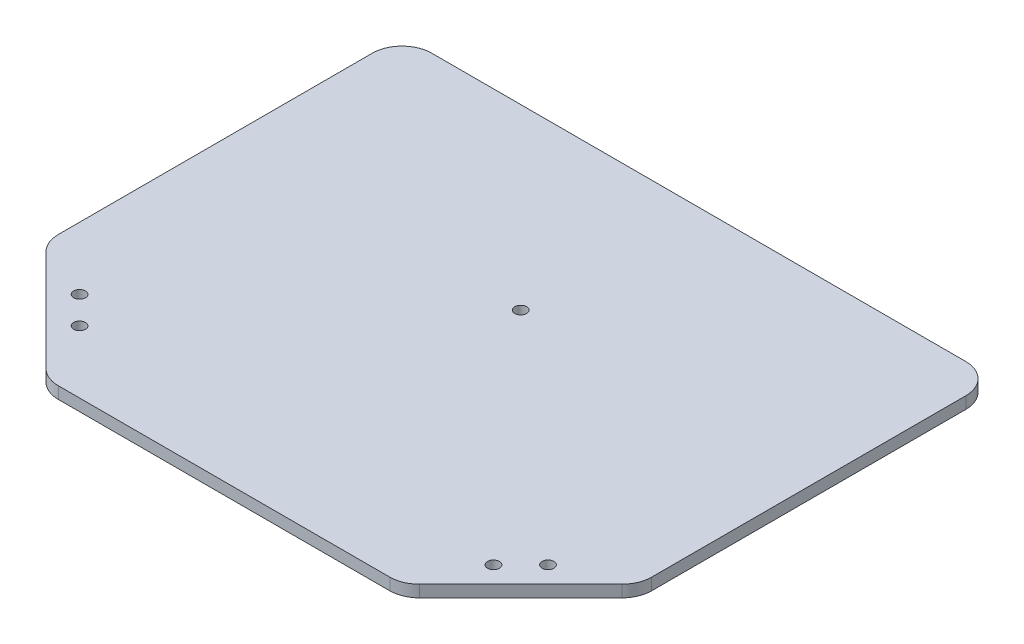
ISO-10303-21;
HEADER;
FILE_DESCRIPTION(('STEP AP214'),'2;1');
FILE_NAME('part.step','',(''),(''),'','','');
FILE_SCHEMA(('AUTOMOTIVE_DESIGN { 1 0 10303 214 1 1 1 1 }'));
ENDSEC;
DATA;
#1=APPLICATION_CONTEXT('core data for automotive mechanical design processes');
#2=APPLICATION_PROTOCOL_DEFINITION('international standard','automotive_design',2000,#1);
#3=PRODUCT_CONTEXT('',#1,'mechanical');
#4=PRODUCT('Part','Part','',(#3));
#5=PRODUCT_RELATED_PRODUCT_CATEGORY('part','',(#4));
#6=PRODUCT_DEFINITION_FORMATION('','',#4);
#7=PRODUCT_DEFINITION_CONTEXT('part definition',#1,'design');
#8=PRODUCT_DEFINITION('design','',#6,#7);
#9=PRODUCT_DEFINITION_SHAPE('','',#8);
#10=(LENGTH_UNIT() NAMED_UNIT(*) SI_UNIT(.MILLI.,.METRE.));
#11=(NAMED_UNIT(*) PLANE_ANGLE_UNIT() SI_UNIT($,.RADIAN.));
#12=(NAMED_UNIT(*) SI_UNIT($,.STERADIAN.) SOLID_ANGLE_UNIT());
#13=UNCERTAINTY_MEASURE_WITH_UNIT(LENGTH_MEASURE(1.E-05),#10,'distance_accuracy_value','');
#14=(GEOMETRIC_REPRESENTATION_CONTEXT(3) GLOBAL_UNCERTAINTY_ASSIGNED_CONTEXT((#13)) GLOBAL_UNIT_ASSIGNED_CONTEXT((#10,
#11,#12)) REPRESENTATION_CONTEXT('',''));
#15=CARTESIAN_POINT('',(0.,0.,0.));
#16=DIRECTION('',(0.,0.,1.));
#17=DIRECTION('',(1.,0.,0.));
#18=AXIS2_PLACEMENT_3D('',#15,#16,#17);
#19=CARTESIAN_POINT('',(-100.,4.,-60.));
#20=DIRECTION('',(0.,0.,1.));
#21=DIRECTION('',(1.,0.,0.));
#22=AXIS2_PLACEMENT_3D('',#19,#20,#21);
#23=PLANE('',#22);
#24=DIRECTION('',(-1.,0.,0.));
#25=VECTOR('',#24,1.);
#26=CARTESIAN_POINT('',(-100.,0.,-60.));
#27=LINE('',#26,#25);
#28=CARTESIAN_POINT('',(90.,0.,-60.));
#29=VERTEX_POINT('',#28);
#30=CARTESIAN_POINT('',(-90.,0.,-60.));
#31=VERTEX_POINT('',#30);
#32=EDGE_CURVE('E252',#29,#31,#27,.T.);
#33=ORIENTED_EDGE('',*,*,#32,.T.);
#34=DIRECTION('',(0.,-1.,0.));
#35=VECTOR('',#34,1.);
#36=CARTESIAN_POINT('',(-90.,4.,-60.));
#37=LINE('',#36,#35);
#38=CARTESIAN_POINT('',(-90.,4.,-60.));
#39=VERTEX_POINT('',#38);
#40=EDGE_CURVE('E222',#31,#39,#37,.F.);
#41=ORIENTED_EDGE('',*,*,#40,.T.);
#42=DIRECTION('',(-1.,0.,0.));
#43=VECTOR('',#42,1.);
#44=CARTESIAN_POINT('',(-100.,4.,-60.));
#45=LINE('',#44,#43);
#46=CARTESIAN_POINT('',(90.,4.,-60.));
#47=VERTEX_POINT('',#46);
#48=EDGE_CURVE('E172',#47,#39,#45,.T.);
#49=ORIENTED_EDGE('',*,*,#48,.F.);
#50=DIRECTION('',(0.,-1.,0.));
#51=VECTOR('',#50,1.);
#52=CARTESIAN_POINT('',(90.,4.,-60.));
#53=LINE('',#52,#51);
#54=EDGE_CURVE('E218',#47,#29,#53,.T.);
#55=ORIENTED_EDGE('',*,*,#54,.T.);
#56=EDGE_LOOP('',(#33,#41,#49,#55));
#57=FACE_BOUND('',#56,.T.);
#58=ADVANCED_FACE('F38',(#57),#23,.F.);
#59=CARTESIAN_POINT('',(-100.,4.,-60.));
#60=DIRECTION('',(1.,0.,0.));
#61=DIRECTION('',(0.,0.,-1.));
#62=AXIS2_PLACEMENT_3D('',#59,#60,#61);
#63=PLANE('',#62);
#64=DIRECTION('',(0.,0.,1.));
#65=VECTOR('',#64,1.);
#66=CARTESIAN_POINT('',(-100.,0.,-60.));
#67=LINE('',#66,#65);
#68=CARTESIAN_POINT('',(-100.,0.,-50.));
#69=VERTEX_POINT('',#68);
#70=CARTESIAN_POINT('',(-100.,0.,55.857864376269));
#71=VERTEX_POINT('',#70);
#72=EDGE_CURVE('E166',#69,#71,#67,.T.);
#73=ORIENTED_EDGE('',*,*,#72,.T.);
#74=DIRECTION('',(0.,-1.,0.));
#75=VECTOR('',#74,1.);
#76=CARTESIAN_POINT('',(-100.,4.,55.857864376269));
#77=LINE('',#76,#75);
#78=CARTESIAN_POINT('',(-100.,4.,55.857864376269));
#79=VERTEX_POINT('',#78);
#80=EDGE_CURVE('E215',#71,#79,#77,.F.);
#81=ORIENTED_EDGE('',*,*,#80,.T.);
#82=DIRECTION('',(0.,0.,1.));
#83=VECTOR('',#82,1.);
#84=CARTESIAN_POINT('',(-100.,4.,-60.));
#85=LINE('',#84,#83);
#86=CARTESIAN_POINT('',(-100.,4.,-50.));
#87=VERTEX_POINT('',#86);
#88=EDGE_CURVE('E273',#87,#79,#85,.T.);
#89=ORIENTED_EDGE('',*,*,#88,.F.);
#90=DIRECTION('',(0.,-1.,0.));
#91=VECTOR('',#90,1.);
#92=CARTESIAN_POINT('',(-100.,4.,-50.));
#93=LINE('',#92,#91);
#94=EDGE_CURVE('E211',#87,#69,#93,.T.);
#95=ORIENTED_EDGE('',*,*,#94,.T.);
#96=EDGE_LOOP('',(#73,#81,#89,#95));
#97=FACE_BOUND('',#96,.T.);
#98=ADVANCED_FACE('F261',(#97),#63,.F.);
#99=CARTESIAN_POINT('',(-60.,4.,100.));
#100=DIRECTION('',(0.707106781186547,0.,-0.707106781186548));
#101=DIRECTION('',(-0.707106781186548,0.,-0.707106781186547));
#102=AXIS2_PLACEMENT_3D('',#99,#100,#101);
#103=PLANE('',#102);
#104=DIRECTION('',(0.707106781186548,0.,0.707106781186547));
#105=VECTOR('',#104,1.);
#106=CARTESIAN_POINT('',(-60.,0.,100.));
#107=LINE('',#106,#105);
#108=CARTESIAN_POINT('',(-97.0710678118655,0.,62.9289321881345));
#109=VERTEX_POINT('',#108);
#110=CARTESIAN_POINT('',(-62.9289321881345,0.,97.0710678118655));
#111=VERTEX_POINT('',#110);
#112=EDGE_CURVE('E159',#109,#111,#107,.T.);
#113=ORIENTED_EDGE('',*,*,#112,.T.);
#114=DIRECTION('',(0.,-1.,0.));
#115=VECTOR('',#114,1.);
#116=CARTESIAN_POINT('',(-62.9289321881345,4.,97.0710678118655));
#117=LINE('',#116,#115);
#118=CARTESIAN_POINT('',(-62.9289321881345,4.,97.0710678118655));
#119=VERTEX_POINT('',#118);
#120=EDGE_CURVE('E134',#111,#119,#117,.F.);
#121=ORIENTED_EDGE('',*,*,#120,.T.);
#122=DIRECTION('',(0.707106781186548,0.,0.707106781186547));
#123=VECTOR('',#122,1.);
#124=CARTESIAN_POINT('',(-60.,4.,100.));
#125=LINE('',#124,#123);
#126=CARTESIAN_POINT('',(-97.0710678118655,4.,62.9289321881345));
#127=VERTEX_POINT('',#126);
#128=EDGE_CURVE('E272',#127,#119,#125,.T.);
#129=ORIENTED_EDGE('',*,*,#128,.F.);
#130=DIRECTION('',(0.,-1.,0.));
#131=VECTOR('',#130,1.);
#132=CARTESIAN_POINT('',(-97.0710678118655,4.,62.9289321881345));
#133=LINE('',#132,#131);
#134=EDGE_CURVE('E140',#127,#109,#133,.T.);
#135=ORIENTED_EDGE('',*,*,#134,.T.);
#136=EDGE_LOOP('',(#113,#121,#129,#135));
#137=FACE_BOUND('',#136,.T.);
#138=ADVANCED_FACE('F275',(#137),#103,.F.);
#139=CARTESIAN_POINT('',(60.,4.,100.));
#140=DIRECTION('',(0.,0.,-1.));
#141=DIRECTION('',(-1.,0.,0.));
#142=AXIS2_PLACEMENT_3D('',#139,#140,#141);
#143=PLANE('',#142);
#144=DIRECTION('',(1.,0.,0.));
#145=VECTOR('',#144,1.);
#146=CARTESIAN_POINT('',(60.,4.,100.));
#147=LINE('',#146,#145);
#148=CARTESIAN_POINT('',(-55.857864376269,4.,100.));
#149=VERTEX_POINT('',#148);
#150=CARTESIAN_POINT('',(55.857864376269,4.,100.));
#151=VERTEX_POINT('',#150);
#152=EDGE_CURVE('E150',#149,#151,#147,.T.);
#153=ORIENTED_EDGE('',*,*,#152,.F.);
#154=DIRECTION('',(0.,-1.,0.));
#155=VECTOR('',#154,1.);
#156=CARTESIAN_POINT('',(-55.857864376269,4.,100.));
#157=LINE('',#156,#155);
#158=CARTESIAN_POINT('',(-55.857864376269,0.,100.));
#159=VERTEX_POINT('',#158);
#160=EDGE_CURVE('E133',#149,#159,#157,.T.);
#161=ORIENTED_EDGE('',*,*,#160,.T.);
#162=DIRECTION('',(1.,0.,0.));
#163=VECTOR('',#162,1.);
#164=CARTESIAN_POINT('',(60.,0.,100.));
#165=LINE('',#164,#163);
#166=CARTESIAN_POINT('',(55.857864376269,0.,100.));
#167=VERTEX_POINT('',#166);
#168=EDGE_CURVE('E147',#159,#167,#165,.T.);
#169=ORIENTED_EDGE('',*,*,#168,.T.);
#170=DIRECTION('',(0.,-1.,0.));
#171=VECTOR('',#170,1.);
#172=CARTESIAN_POINT('',(55.857864376269,4.,100.));
#173=LINE('',#172,#171);
#174=EDGE_CURVE('E153',#167,#151,#173,.F.);
#175=ORIENTED_EDGE('',*,*,#174,.T.);
#176=EDGE_LOOP('',(#153,#161,#169,#175));
#177=FACE_BOUND('',#176,.T.);
#178=ADVANCED_FACE('F146',(#177),#143,.F.);
#179=CARTESIAN_POINT('',(100.,4.,60.));
#180=DIRECTION('',(-0.707106781186547,0.,-0.707106781186548));
#181=DIRECTION('',(-0.707106781186548,0.,0.707106781186547));
#182=AXIS2_PLACEMENT_3D('',#179,#180,#181);
#183=PLANE('',#182);
#184=DIRECTION('',(0.707106781186548,0.,-0.707106781186547));
#185=VECTOR('',#184,1.);
#186=CARTESIAN_POINT('',(100.,0.,60.));
#187=LINE('',#186,#185);
#188=CARTESIAN_POINT('',(62.9289321881345,0.,97.0710678118655));
#189=VERTEX_POINT('',#188);
#190=CARTESIAN_POINT('',(97.0710678118655,0.,62.9289321881345));
#191=VERTEX_POINT('',#190);
#192=EDGE_CURVE('E158',#189,#191,#187,.T.);
#193=ORIENTED_EDGE('',*,*,#192,.T.);
#194=DIRECTION('',(0.,-1.,0.));
#195=VECTOR('',#194,1.);
#196=CARTESIAN_POINT('',(97.0710678118655,4.,62.9289321881345));
#197=LINE('',#196,#195);
#198=CARTESIAN_POINT('',(97.0710678118655,4.,62.9289321881345));
#199=VERTEX_POINT('',#198);
#200=EDGE_CURVE('E11',#191,#199,#197,.F.);
#201=ORIENTED_EDGE('',*,*,#200,.T.);
#202=DIRECTION('',(0.707106781186548,0.,-0.707106781186547));
#203=VECTOR('',#202,1.);
#204=CARTESIAN_POINT('',(100.,4.,60.));
#205=LINE('',#204,#203);
#206=CARTESIAN_POINT('',(62.9289321881345,4.,97.0710678118655));
#207=VERTEX_POINT('',#206);
#208=EDGE_CURVE('E237',#207,#199,#205,.T.);
#209=ORIENTED_EDGE('',*,*,#208,.F.);
#210=DIRECTION('',(0.,-1.,0.));
#211=VECTOR('',#210,1.);
#212=CARTESIAN_POINT('',(62.9289321881345,4.,97.0710678118655));
#213=LINE('',#212,#211);
#214=EDGE_CURVE('E47',#207,#189,#213,.T.);
#215=ORIENTED_EDGE('',*,*,#214,.T.);
#216=EDGE_LOOP('',(#193,#201,#209,#215));
#217=FACE_BOUND('',#216,.T.);
#218=ADVANCED_FACE('F235',(#217),#183,.F.);
#219=CARTESIAN_POINT('',(100.,4.,-60.));
#220=DIRECTION('',(-1.,0.,0.));
#221=DIRECTION('',(0.,0.,1.));
#222=AXIS2_PLACEMENT_3D('',#219,#220,#221);
#223=PLANE('',#222);
#224=DIRECTION('',(0.,0.,-1.));
#225=VECTOR('',#224,1.);
#226=CARTESIAN_POINT('',(100.,0.,-60.));
#227=LINE('',#226,#225);
#228=CARTESIAN_POINT('',(100.,0.,55.857864376269));
#229=VERTEX_POINT('',#228);
#230=CARTESIAN_POINT('',(100.,0.,-50.));
#231=VERTEX_POINT('',#230);
#232=EDGE_CURVE('E164',#229,#231,#227,.T.);
#233=ORIENTED_EDGE('',*,*,#232,.T.);
#234=DIRECTION('',(0.,-1.,0.));
#235=VECTOR('',#234,1.);
#236=CARTESIAN_POINT('',(100.,4.,-50.));
#237=LINE('',#236,#235);
#238=CARTESIAN_POINT('',(100.,4.,-50.));
#239=VERTEX_POINT('',#238);
#240=EDGE_CURVE('E54',#231,#239,#237,.F.);
#241=ORIENTED_EDGE('',*,*,#240,.T.);
#242=DIRECTION('',(0.,0.,-1.));
#243=VECTOR('',#242,1.);
#244=CARTESIAN_POINT('',(100.,4.,-60.));
#245=LINE('',#244,#243);
#246=CARTESIAN_POINT('',(100.,4.,55.857864376269));
#247=VERTEX_POINT('',#246);
#248=EDGE_CURVE('E174',#247,#239,#245,.T.);
#249=ORIENTED_EDGE('',*,*,#248,.F.);
#250=DIRECTION('',(0.,-1.,0.));
#251=VECTOR('',#250,1.);
#252=CARTESIAN_POINT('',(100.,4.,55.857864376269));
#253=LINE('',#252,#251);
#254=EDGE_CURVE('E225',#247,#229,#253,.T.);
#255=ORIENTED_EDGE('',*,*,#254,.T.);
#256=EDGE_LOOP('',(#233,#241,#249,#255));
#257=FACE_BOUND('',#256,.T.);
#258=ADVANCED_FACE('F244',(#257),#223,.F.);
#259=CARTESIAN_POINT('',(0.,4.,0.));
#260=DIRECTION('',(0.,-1.,0.));
#261=DIRECTION('',(0.,0.,-1.));
#262=AXIS2_PLACEMENT_3D('',#259,#260,#261);
#263=PLANE('',#262);
#264=CARTESIAN_POINT('',(-78.9393398282202,4.,69.746951672795));
#265=DIRECTION('',(0.,1.,0.));
#266=DIRECTION('',(0.,0.,1.));
#267=AXIS2_PLACEMENT_3D('',#264,#265,#266);
#268=CIRCLE('',#267,2.);
#269=CARTESIAN_POINT('',(-78.9393398282202,4.,71.746951672795));
#270=VERTEX_POINT('',#269);
#271=EDGE_CURVE('E289',#270,#270,#268,.T.);
#272=ORIENTED_EDGE('',*,*,#271,.F.);
#273=EDGE_LOOP('',(#272));
#274=FACE_BOUND('',#273,.T.);
#275=CARTESIAN_POINT('',(-69.746951672795,4.,78.9393398282201));
#276=DIRECTION('',(0.,1.,0.));
#277=DIRECTION('',(0.,0.,1.));
#278=AXIS2_PLACEMENT_3D('',#275,#276,#277);
#279=CIRCLE('',#278,2.);
#280=CARTESIAN_POINT('',(-69.746951672795,4.,80.9393398282201));
#281=VERTEX_POINT('',#280);
#282=EDGE_CURVE('E313',#281,#281,#279,.T.);
#283=ORIENTED_EDGE('',*,*,#282,.F.);
#284=EDGE_LOOP('',(#283));
#285=FACE_BOUND('',#284,.T.);
#286=CARTESIAN_POINT('',(69.746951672795,4.,78.9393398282201));
#287=DIRECTION('',(0.,1.,0.));
#288=DIRECTION('',(0.,0.,-1.));
#289=AXIS2_PLACEMENT_3D('',#286,#287,#288);
#290=CIRCLE('',#289,2.);
#291=CARTESIAN_POINT('',(69.746951672795,4.,76.9393398282201));
#292=VERTEX_POINT('',#291);
#293=EDGE_CURVE('E305',#292,#292,#290,.T.);
#294=ORIENTED_EDGE('',*,*,#293,.F.);
#295=EDGE_LOOP('',(#294));
#296=FACE_BOUND('',#295,.T.);
#297=CARTESIAN_POINT('',(78.9393398282202,4.,69.746951672795));
#298=DIRECTION('',(0.,1.,0.));
#299=DIRECTION('',(0.,0.,-1.));
#300=AXIS2_PLACEMENT_3D('',#297,#298,#299);
#301=CIRCLE('',#300,2.);
#302=CARTESIAN_POINT('',(78.9393398282202,4.,67.746951672795));
#303=VERTEX_POINT('',#302);
#304=EDGE_CURVE('E297',#303,#303,#301,.T.);
#305=ORIENTED_EDGE('',*,*,#304,.F.);
#306=EDGE_LOOP('',(#305));
#307=FACE_BOUND('',#306,.T.);
#308=CARTESIAN_POINT('',(0.,4.,0.));
#309=DIRECTION('',(0.,1.,0.));
#310=DIRECTION('',(0.,0.,1.));
#311=AXIS2_PLACEMENT_3D('',#308,#309,#310);
#312=CIRCLE('',#311,2.);
#313=CARTESIAN_POINT('',(0.,4.,2.));
#314=VERTEX_POINT('',#313);
#315=EDGE_CURVE('E285',#314,#314,#312,.T.);
#316=ORIENTED_EDGE('',*,*,#315,.F.);
#317=EDGE_LOOP('',(#316));
#318=FACE_BOUND('',#317,.T.);
#319=ORIENTED_EDGE('',*,*,#128,.T.);
#320=CARTESIAN_POINT('',(-55.857864376269,4.,90.));
#321=DIRECTION('',(0.,-1.,0.));
#322=DIRECTION('',(0.,0.,-1.));
#323=AXIS2_PLACEMENT_3D('',#320,#321,#322);
#324=CIRCLE('',#323,10.);
#325=EDGE_CURVE('E208',#119,#149,#324,.F.);
#326=ORIENTED_EDGE('',*,*,#325,.T.);
#327=ORIENTED_EDGE('',*,*,#152,.T.);
#328=CARTESIAN_POINT('',(55.857864376269,4.,90.));
#329=DIRECTION('',(0.,-1.,0.));
#330=DIRECTION('',(0.,0.,-1.));
#331=AXIS2_PLACEMENT_3D('',#328,#329,#330);
#332=CIRCLE('',#331,10.);
#333=EDGE_CURVE('E194',#151,#207,#332,.F.);
#334=ORIENTED_EDGE('',*,*,#333,.T.);
#335=ORIENTED_EDGE('',*,*,#208,.T.);
#336=CARTESIAN_POINT('',(90.,4.,55.857864376269));
#337=DIRECTION('',(0.,-1.,0.));
#338=DIRECTION('',(0.,0.,-1.));
#339=AXIS2_PLACEMENT_3D('',#336,#337,#338);
#340=CIRCLE('',#339,10.);
#341=EDGE_CURVE('E61',#199,#247,#340,.F.);
#342=ORIENTED_EDGE('',*,*,#341,.T.);
#343=ORIENTED_EDGE('',*,*,#248,.T.);
#344=CARTESIAN_POINT('',(90.,4.,-50.));
#345=DIRECTION('',(0.,-1.,0.));
#346=DIRECTION('',(0.,0.,-1.));
#347=AXIS2_PLACEMENT_3D('',#344,#345,#346);
#348=CIRCLE('',#347,10.);
#349=EDGE_CURVE('E199',#239,#47,#348,.F.);
#350=ORIENTED_EDGE('',*,*,#349,.T.);
#351=ORIENTED_EDGE('',*,*,#48,.T.);
#352=CARTESIAN_POINT('',(-90.,4.,-50.));
#353=DIRECTION('',(0.,-1.,0.));
#354=DIRECTION('',(0.,0.,-1.));
#355=AXIS2_PLACEMENT_3D('',#352,#353,#354);
#356=CIRCLE('',#355,10.);
#357=EDGE_CURVE('E202',#39,#87,#356,.F.);
#358=ORIENTED_EDGE('',*,*,#357,.T.);
#359=ORIENTED_EDGE('',*,*,#88,.T.);
#360=CARTESIAN_POINT('',(-90.,4.,55.857864376269));
#361=DIRECTION('',(0.,-1.,0.));
#362=DIRECTION('',(0.,0.,-1.));
#363=AXIS2_PLACEMENT_3D('',#360,#361,#362);
#364=CIRCLE('',#363,10.);
#365=EDGE_CURVE('E205',#79,#127,#364,.F.);
#366=ORIENTED_EDGE('',*,*,#365,.T.);
#367=EDGE_LOOP('',(#319,#326,#327,#334,#335,#342,#343,#350,#351,#358,#359,#366));
#368=FACE_BOUND('',#367,.T.);
#369=ADVANCED_FACE('F271',(#274,#285,#296,#307,#318,#368),#263,.F.);
#370=CARTESIAN_POINT('',(0.,0.,0.));
#371=DIRECTION('',(0.,-1.,0.));
#372=DIRECTION('',(0.,0.,-1.));
#373=AXIS2_PLACEMENT_3D('',#370,#371,#372);
#374=PLANE('',#373);
#375=CARTESIAN_POINT('',(-78.9393398282202,0.,69.746951672795));
#376=DIRECTION('',(0.,1.,0.));
#377=DIRECTION('',(0.,0.,1.));
#378=AXIS2_PLACEMENT_3D('',#375,#376,#377);
#379=CIRCLE('',#378,2.);
#380=CARTESIAN_POINT('',(-78.9393398282202,0.,71.746951672795));
#381=VERTEX_POINT('',#380);
#382=EDGE_CURVE('E317',#381,#381,#379,.T.);
#383=ORIENTED_EDGE('',*,*,#382,.T.);
#384=EDGE_LOOP('',(#383));
#385=FACE_BOUND('',#384,.T.);
#386=CARTESIAN_POINT('',(-69.746951672795,0.,78.9393398282201));
#387=DIRECTION('',(0.,1.,0.));
#388=DIRECTION('',(0.,0.,1.));
#389=AXIS2_PLACEMENT_3D('',#386,#387,#388);
#390=CIRCLE('',#389,2.);
#391=CARTESIAN_POINT('',(-69.746951672795,0.,80.9393398282201));
#392=VERTEX_POINT('',#391);
#393=EDGE_CURVE('E309',#392,#392,#390,.T.);
#394=ORIENTED_EDGE('',*,*,#393,.T.);
#395=EDGE_LOOP('',(#394));
#396=FACE_BOUND('',#395,.T.);
#397=CARTESIAN_POINT('',(69.746951672795,0.,78.9393398282201));
#398=DIRECTION('',(0.,1.,0.));
#399=DIRECTION('',(0.,0.,-1.));
#400=AXIS2_PLACEMENT_3D('',#397,#398,#399);
#401=CIRCLE('',#400,2.);
#402=CARTESIAN_POINT('',(69.746951672795,0.,76.9393398282201));
#403=VERTEX_POINT('',#402);
#404=EDGE_CURVE('E301',#403,#403,#401,.T.);
#405=ORIENTED_EDGE('',*,*,#404,.T.);
#406=EDGE_LOOP('',(#405));
#407=FACE_BOUND('',#406,.T.);
#408=CARTESIAN_POINT('',(78.9393398282202,0.,69.746951672795));
#409=DIRECTION('',(0.,1.,0.));
#410=DIRECTION('',(0.,0.,-1.));
#411=AXIS2_PLACEMENT_3D('',#408,#409,#410);
#412=CIRCLE('',#411,2.);
#413=CARTESIAN_POINT('',(78.9393398282202,0.,67.746951672795));
#414=VERTEX_POINT('',#413);
#415=EDGE_CURVE('E293',#414,#414,#412,.T.);
#416=ORIENTED_EDGE('',*,*,#415,.T.);
#417=EDGE_LOOP('',(#416));
#418=FACE_BOUND('',#417,.T.);
#419=CARTESIAN_POINT('',(0.,0.,0.));
#420=DIRECTION('',(0.,1.,0.));
#421=DIRECTION('',(0.,0.,1.));
#422=AXIS2_PLACEMENT_3D('',#419,#420,#421);
#423=CIRCLE('',#422,2.);
#424=CARTESIAN_POINT('',(0.,0.,2.));
#425=VERTEX_POINT('',#424);
#426=EDGE_CURVE('E255',#425,#425,#423,.T.);
#427=ORIENTED_EDGE('',*,*,#426,.T.);
#428=EDGE_LOOP('',(#427));
#429=FACE_BOUND('',#428,.T.);
#430=ORIENTED_EDGE('',*,*,#168,.F.);
#431=CARTESIAN_POINT('',(-55.857864376269,0.,90.));
#432=DIRECTION('',(0.,-1.,0.));
#433=DIRECTION('',(0.,0.,-1.));
#434=AXIS2_PLACEMENT_3D('',#431,#432,#433);
#435=CIRCLE('',#434,10.);
#436=EDGE_CURVE('E129',#159,#111,#435,.T.);
#437=ORIENTED_EDGE('',*,*,#436,.T.);
#438=ORIENTED_EDGE('',*,*,#112,.F.);
#439=CARTESIAN_POINT('',(-90.,0.,55.857864376269));
#440=DIRECTION('',(0.,-1.,0.));
#441=DIRECTION('',(0.,0.,-1.));
#442=AXIS2_PLACEMENT_3D('',#439,#440,#441);
#443=CIRCLE('',#442,10.);
#444=EDGE_CURVE('E141',#109,#71,#443,.T.);
#445=ORIENTED_EDGE('',*,*,#444,.T.);
#446=ORIENTED_EDGE('',*,*,#72,.F.);
#447=CARTESIAN_POINT('',(-90.,0.,-50.));
#448=DIRECTION('',(0.,-1.,0.));
#449=DIRECTION('',(0.,0.,-1.));
#450=AXIS2_PLACEMENT_3D('',#447,#448,#449);
#451=CIRCLE('',#450,10.);
#452=EDGE_CURVE('E184',#69,#31,#451,.T.);
#453=ORIENTED_EDGE('',*,*,#452,.T.);
#454=ORIENTED_EDGE('',*,*,#32,.F.);
#455=CARTESIAN_POINT('',(90.,0.,-50.));
#456=DIRECTION('',(0.,-1.,0.));
#457=DIRECTION('',(0.,0.,-1.));
#458=AXIS2_PLACEMENT_3D('',#455,#456,#457);
#459=CIRCLE('',#458,10.);
#460=EDGE_CURVE('E181',#29,#231,#459,.T.);
#461=ORIENTED_EDGE('',*,*,#460,.T.);
#462=ORIENTED_EDGE('',*,*,#232,.F.);
#463=CARTESIAN_POINT('',(90.,0.,55.857864376269));
#464=DIRECTION('',(0.,-1.,0.));
#465=DIRECTION('',(0.,0.,-1.));
#466=AXIS2_PLACEMENT_3D('',#463,#464,#465);
#467=CIRCLE('',#466,10.);
#468=EDGE_CURVE('E178',#229,#191,#467,.T.);
#469=ORIENTED_EDGE('',*,*,#468,.T.);
#470=ORIENTED_EDGE('',*,*,#192,.F.);
#471=CARTESIAN_POINT('',(55.857864376269,0.,90.));
#472=DIRECTION('',(0.,-1.,0.));
#473=DIRECTION('',(0.,0.,-1.));
#474=AXIS2_PLACEMENT_3D('',#471,#472,#473);
#475=CIRCLE('',#474,10.);
#476=EDGE_CURVE('E152',#189,#167,#475,.T.);
#477=ORIENTED_EDGE('',*,*,#476,.T.);
#478=EDGE_LOOP('',(#430,#437,#438,#445,#446,#453,#454,#461,#462,#469,#470,#477));
#479=FACE_BOUND('',#478,.T.);
#480=ADVANCED_FACE('F155',(#385,#396,#407,#418,#429,#479),#374,.T.);
#481=CARTESIAN_POINT('',(0.,0.,0.));
#482=DIRECTION('',(0.,1.,0.));
#483=DIRECTION('',(0.,0.,1.));
#484=AXIS2_PLACEMENT_3D('',#481,#482,#483);
#485=CYLINDRICAL_SURFACE('',#484,2.);
#486=ORIENTED_EDGE('',*,*,#426,.F.);
#487=EDGE_LOOP('',(#486));
#488=FACE_BOUND('',#487,.T.);
#489=ORIENTED_EDGE('',*,*,#315,.T.);
#490=EDGE_LOOP('',(#489));
#491=FACE_BOUND('',#490,.T.);
#492=ADVANCED_FACE('F339',(#488,#491),#485,.F.);
#493=CARTESIAN_POINT('',(-55.857864376269,4.,90.));
#494=DIRECTION('',(0.,-1.,0.));
#495=DIRECTION('',(0.,0.,-1.));
#496=AXIS2_PLACEMENT_3D('',#493,#494,#495);
#497=CYLINDRICAL_SURFACE('',#496,10.);
#498=ORIENTED_EDGE('',*,*,#325,.F.);
#499=ORIENTED_EDGE('',*,*,#120,.F.);
#500=ORIENTED_EDGE('',*,*,#436,.F.);
#501=ORIENTED_EDGE('',*,*,#160,.F.);
#502=EDGE_LOOP('',(#498,#499,#500,#501));
#503=FACE_BOUND('',#502,.T.);
#504=ADVANCED_FACE('F132',(#503),#497,.T.);
#505=CARTESIAN_POINT('',(-90.,4.,55.857864376269));
#506=DIRECTION('',(0.,-1.,0.));
#507=DIRECTION('',(0.,0.,-1.));
#508=AXIS2_PLACEMENT_3D('',#505,#506,#507);
#509=CYLINDRICAL_SURFACE('',#508,10.);
#510=ORIENTED_EDGE('',*,*,#365,.F.);
#511=ORIENTED_EDGE('',*,*,#80,.F.);
#512=ORIENTED_EDGE('',*,*,#444,.F.);
#513=ORIENTED_EDGE('',*,*,#134,.F.);
#514=EDGE_LOOP('',(#510,#511,#512,#513));
#515=FACE_BOUND('',#514,.T.);
#516=ADVANCED_FACE('F267',(#515),#509,.T.);
#517=CARTESIAN_POINT('',(-90.,4.,-50.));
#518=DIRECTION('',(0.,-1.,0.));
#519=DIRECTION('',(0.,0.,-1.));
#520=AXIS2_PLACEMENT_3D('',#517,#518,#519);
#521=CYLINDRICAL_SURFACE('',#520,10.);
#522=ORIENTED_EDGE('',*,*,#357,.F.);
#523=ORIENTED_EDGE('',*,*,#40,.F.);
#524=ORIENTED_EDGE('',*,*,#452,.F.);
#525=ORIENTED_EDGE('',*,*,#94,.F.);
#526=EDGE_LOOP('',(#522,#523,#524,#525));
#527=FACE_BOUND('',#526,.T.);
#528=ADVANCED_FACE('F364',(#527),#521,.T.);
#529=CARTESIAN_POINT('',(90.,4.,-50.));
#530=DIRECTION('',(0.,-1.,0.));
#531=DIRECTION('',(0.,0.,-1.));
#532=AXIS2_PLACEMENT_3D('',#529,#530,#531);
#533=CYLINDRICAL_SURFACE('',#532,10.);
#534=ORIENTED_EDGE('',*,*,#349,.F.);
#535=ORIENTED_EDGE('',*,*,#240,.F.);
#536=ORIENTED_EDGE('',*,*,#460,.F.);
#537=ORIENTED_EDGE('',*,*,#54,.F.);
#538=EDGE_LOOP('',(#534,#535,#536,#537));
#539=FACE_BOUND('',#538,.T.);
#540=ADVANCED_FACE('F367',(#539),#533,.T.);
#541=CARTESIAN_POINT('',(90.,4.,55.857864376269));
#542=DIRECTION('',(0.,-1.,0.));
#543=DIRECTION('',(0.,0.,-1.));
#544=AXIS2_PLACEMENT_3D('',#541,#542,#543);
#545=CYLINDRICAL_SURFACE('',#544,10.);
#546=ORIENTED_EDGE('',*,*,#341,.F.);
#547=ORIENTED_EDGE('',*,*,#200,.F.);
#548=ORIENTED_EDGE('',*,*,#468,.F.);
#549=ORIENTED_EDGE('',*,*,#254,.F.);
#550=EDGE_LOOP('',(#546,#547,#548,#549));
#551=FACE_BOUND('',#550,.T.);
#552=ADVANCED_FACE('F243',(#551),#545,.T.);
#553=CARTESIAN_POINT('',(55.857864376269,4.,90.));
#554=DIRECTION('',(0.,-1.,0.));
#555=DIRECTION('',(0.,0.,-1.));
#556=AXIS2_PLACEMENT_3D('',#553,#554,#555);
#557=CYLINDRICAL_SURFACE('',#556,10.);
#558=ORIENTED_EDGE('',*,*,#333,.F.);
#559=ORIENTED_EDGE('',*,*,#174,.F.);
#560=ORIENTED_EDGE('',*,*,#476,.F.);
#561=ORIENTED_EDGE('',*,*,#214,.F.);
#562=EDGE_LOOP('',(#558,#559,#560,#561));
#563=FACE_BOUND('',#562,.T.);
#564=ADVANCED_FACE('F40',(#563),#557,.T.);
#565=CARTESIAN_POINT('',(78.9393398282202,4.,69.746951672795));
#566=DIRECTION('',(0.,-1.,0.));
#567=DIRECTION('',(0.,0.,-1.));
#568=AXIS2_PLACEMENT_3D('',#565,#566,#567);
#569=CYLINDRICAL_SURFACE('',#568,2.);
#570=ORIENTED_EDGE('',*,*,#304,.T.);
#571=EDGE_LOOP('',(#570));
#572=FACE_BOUND('',#571,.T.);
#573=ORIENTED_EDGE('',*,*,#415,.F.);
#574=EDGE_LOOP('',(#573));
#575=FACE_BOUND('',#574,.T.);
#576=ADVANCED_FACE('F375',(#572,#575),#569,.F.);
#577=CARTESIAN_POINT('',(69.746951672795,4.,78.9393398282201));
#578=DIRECTION('',(0.,-1.,0.));
#579=DIRECTION('',(0.,0.,-1.));
#580=AXIS2_PLACEMENT_3D('',#577,#578,#579);
#581=CYLINDRICAL_SURFACE('',#580,2.);
#582=ORIENTED_EDGE('',*,*,#293,.T.);
#583=EDGE_LOOP('',(#582));
#584=FACE_BOUND('',#583,.T.);
#585=ORIENTED_EDGE('',*,*,#404,.F.);
#586=EDGE_LOOP('',(#585));
#587=FACE_BOUND('',#586,.T.);
#588=ADVANCED_FACE('F379',(#584,#587),#581,.F.);
#589=CARTESIAN_POINT('',(-69.746951672795,4.,78.9393398282201));
#590=DIRECTION('',(0.,-1.,0.));
#591=DIRECTION('',(0.,0.,-1.));
#592=AXIS2_PLACEMENT_3D('',#589,#590,#591);
#593=CYLINDRICAL_SURFACE('',#592,2.);
#594=ORIENTED_EDGE('',*,*,#282,.T.);
#595=EDGE_LOOP('',(#594));
#596=FACE_BOUND('',#595,.T.);
#597=ORIENTED_EDGE('',*,*,#393,.F.);
#598=EDGE_LOOP('',(#597));
#599=FACE_BOUND('',#598,.T.);
#600=ADVANCED_FACE('F384',(#596,#599),#593,.F.);
#601=CARTESIAN_POINT('',(-78.9393398282202,4.,69.746951672795));
#602=DIRECTION('',(0.,-1.,0.));
#603=DIRECTION('',(0.,0.,-1.));
#604=AXIS2_PLACEMENT_3D('',#601,#602,#603);
#605=CYLINDRICAL_SURFACE('',#604,2.);
#606=ORIENTED_EDGE('',*,*,#271,.T.);
#607=EDGE_LOOP('',(#606));
#608=FACE_BOUND('',#607,.T.);
#609=ORIENTED_EDGE('',*,*,#382,.F.);
#610=EDGE_LOOP('',(#609));
#611=FACE_BOUND('',#610,.T.);
#612=ADVANCED_FACE('F325',(#608,#611),#605,.F.);
#613=CLOSED_SHELL('',(#58,#98,#138,#178,#218,#258,#369,#480,#492,#504,#516,#528,#540,#552,#564,
#576,#588,#600,#612));
#614=MANIFOLD_SOLID_BREP('B2',#613);
#615=ADVANCED_BREP_SHAPE_REPRESENTATION('',(#18,#614),#14);
#616=SHAPE_DEFINITION_REPRESENTATION(#9,#615);
ENDSEC;
END-ISO-10303-21;
